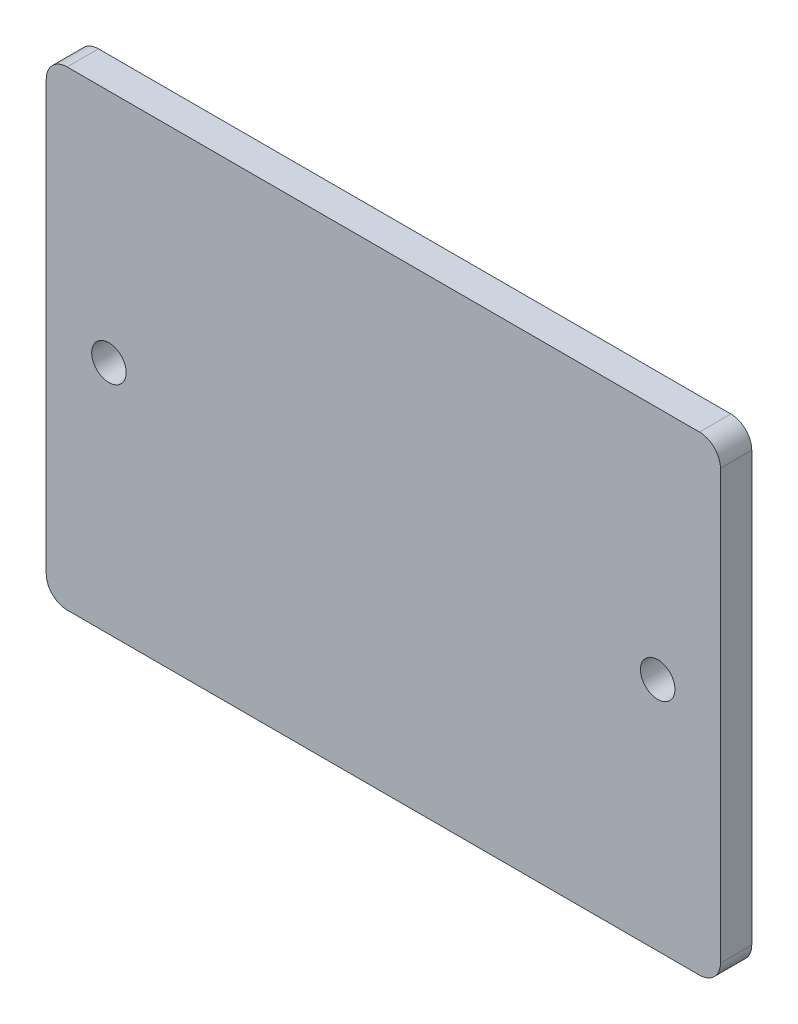
ISO-10303-21;
HEADER;
FILE_DESCRIPTION(('STEP AP214'),'2;1');
FILE_NAME('part.step','',(''),(''),'','','');
FILE_SCHEMA(('AUTOMOTIVE_DESIGN { 1 0 10303 214 1 1 1 1 }'));
ENDSEC;
DATA;
#1=APPLICATION_CONTEXT('core data for automotive mechanical design processes');
#2=APPLICATION_PROTOCOL_DEFINITION('international standard','automotive_design',2000,#1);
#3=PRODUCT_CONTEXT('',#1,'mechanical');
#4=PRODUCT('Part','Part','',(#3));
#5=PRODUCT_RELATED_PRODUCT_CATEGORY('part','',(#4));
#6=PRODUCT_DEFINITION_FORMATION('','',#4);
#7=PRODUCT_DEFINITION_CONTEXT('part definition',#1,'design');
#8=PRODUCT_DEFINITION('design','',#6,#7);
#9=PRODUCT_DEFINITION_SHAPE('','',#8);
#10=(LENGTH_UNIT() NAMED_UNIT(*) SI_UNIT(.MILLI.,.METRE.));
#11=(NAMED_UNIT(*) PLANE_ANGLE_UNIT() SI_UNIT($,.RADIAN.));
#12=(NAMED_UNIT(*) SI_UNIT($,.STERADIAN.) SOLID_ANGLE_UNIT());
#13=UNCERTAINTY_MEASURE_WITH_UNIT(LENGTH_MEASURE(1.E-05),#10,'distance_accuracy_value','');
#14=(GEOMETRIC_REPRESENTATION_CONTEXT(3) GLOBAL_UNCERTAINTY_ASSIGNED_CONTEXT((#13)) GLOBAL_UNIT_ASSIGNED_CONTEXT((#10,
#11,#12)) REPRESENTATION_CONTEXT('',''));
#15=CARTESIAN_POINT('',(0.,0.,0.));
#16=DIRECTION('',(0.,0.,1.));
#17=DIRECTION('',(1.,0.,0.));
#18=AXIS2_PLACEMENT_3D('',#15,#16,#17);
#19=CARTESIAN_POINT('',(32.25,-22.5,3.));
#20=DIRECTION('',(-1.,0.,0.));
#21=DIRECTION('',(0.,0.,1.));
#22=AXIS2_PLACEMENT_3D('',#19,#20,#21);
#23=PLANE('',#22);
#24=DIRECTION('',(0.,0.,-1.));
#25=VECTOR('',#24,1.);
#26=CARTESIAN_POINT('',(32.25,-20.5,3.));
#27=LINE('',#26,#25);
#28=CARTESIAN_POINT('',(32.25,-20.5,3.));
#29=VERTEX_POINT('',#28);
#30=CARTESIAN_POINT('',(32.25,-20.5,0.));
#31=VERTEX_POINT('',#30);
#32=EDGE_CURVE('E150',#29,#31,#27,.T.);
#33=ORIENTED_EDGE('',*,*,#32,.T.);
#34=DIRECTION('',(0.,1.,0.));
#35=VECTOR('',#34,1.);
#36=CARTESIAN_POINT('',(32.25,-22.5,0.));
#37=LINE('',#36,#35);
#38=CARTESIAN_POINT('',(32.25,20.5,0.));
#39=VERTEX_POINT('',#38);
#40=EDGE_CURVE('E130',#31,#39,#37,.T.);
#41=ORIENTED_EDGE('',*,*,#40,.T.);
#42=DIRECTION('',(0.,0.,-1.));
#43=VECTOR('',#42,1.);
#44=CARTESIAN_POINT('',(32.25,20.5,3.));
#45=LINE('',#44,#43);
#46=CARTESIAN_POINT('',(32.25,20.5,3.));
#47=VERTEX_POINT('',#46);
#48=EDGE_CURVE('E148',#39,#47,#45,.F.);
#49=ORIENTED_EDGE('',*,*,#48,.T.);
#50=DIRECTION('',(0.,1.,0.));
#51=VECTOR('',#50,1.);
#52=CARTESIAN_POINT('',(32.25,-22.5,3.));
#53=LINE('',#52,#51);
#54=EDGE_CURVE('E51',#29,#47,#53,.T.);
#55=ORIENTED_EDGE('',*,*,#54,.F.);
#56=EDGE_LOOP('',(#33,#41,#49,#55));
#57=FACE_BOUND('',#56,.T.);
#58=ADVANCED_FACE('F34',(#57),#23,.F.);
#59=CARTESIAN_POINT('',(-32.25,22.5,3.));
#60=DIRECTION('',(0.,-1.,0.));
#61=DIRECTION('',(0.,0.,-1.));
#62=AXIS2_PLACEMENT_3D('',#59,#60,#61);
#63=PLANE('',#62);
#64=DIRECTION('',(-1.,0.,0.));
#65=VECTOR('',#64,1.);
#66=CARTESIAN_POINT('',(-32.25,22.5,0.));
#67=LINE('',#66,#65);
#68=CARTESIAN_POINT('',(30.25,22.5,0.));
#69=VERTEX_POINT('',#68);
#70=CARTESIAN_POINT('',(-30.25,22.5,0.));
#71=VERTEX_POINT('',#70);
#72=EDGE_CURVE('E126',#69,#71,#67,.T.);
#73=ORIENTED_EDGE('',*,*,#72,.T.);
#74=DIRECTION('',(0.,0.,-1.));
#75=VECTOR('',#74,1.);
#76=CARTESIAN_POINT('',(-30.25,22.5,3.));
#77=LINE('',#76,#75);
#78=CARTESIAN_POINT('',(-30.25,22.5,3.));
#79=VERTEX_POINT('',#78);
#80=EDGE_CURVE('E105',#71,#79,#77,.F.);
#81=ORIENTED_EDGE('',*,*,#80,.T.);
#82=DIRECTION('',(-1.,0.,0.));
#83=VECTOR('',#82,1.);
#84=CARTESIAN_POINT('',(-32.25,22.5,3.));
#85=LINE('',#84,#83);
#86=CARTESIAN_POINT('',(30.25,22.5,3.));
#87=VERTEX_POINT('',#86);
#88=EDGE_CURVE('E171',#87,#79,#85,.T.);
#89=ORIENTED_EDGE('',*,*,#88,.F.);
#90=DIRECTION('',(0.,0.,-1.));
#91=VECTOR('',#90,1.);
#92=CARTESIAN_POINT('',(30.25,22.5,3.));
#93=LINE('',#92,#91);
#94=EDGE_CURVE('E110',#87,#69,#93,.T.);
#95=ORIENTED_EDGE('',*,*,#94,.T.);
#96=EDGE_LOOP('',(#73,#81,#89,#95));
#97=FACE_BOUND('',#96,.T.);
#98=ADVANCED_FACE('F187',(#97),#63,.F.);
#99=CARTESIAN_POINT('',(-32.25,-22.5,3.));
#100=DIRECTION('',(1.,0.,0.));
#101=DIRECTION('',(0.,0.,-1.));
#102=AXIS2_PLACEMENT_3D('',#99,#100,#101);
#103=PLANE('',#102);
#104=DIRECTION('',(0.,-1.,0.));
#105=VECTOR('',#104,1.);
#106=CARTESIAN_POINT('',(-32.25,-22.5,0.));
#107=LINE('',#106,#105);
#108=CARTESIAN_POINT('',(-32.25,20.5,0.));
#109=VERTEX_POINT('',#108);
#110=CARTESIAN_POINT('',(-32.25,-20.5,0.));
#111=VERTEX_POINT('',#110);
#112=EDGE_CURVE('E116',#109,#111,#107,.T.);
#113=ORIENTED_EDGE('',*,*,#112,.T.);
#114=DIRECTION('',(0.,0.,-1.));
#115=VECTOR('',#114,1.);
#116=CARTESIAN_POINT('',(-32.25,-20.5,3.));
#117=LINE('',#116,#115);
#118=CARTESIAN_POINT('',(-32.25,-20.5,3.));
#119=VERTEX_POINT('',#118);
#120=EDGE_CURVE('E11',#111,#119,#117,.F.);
#121=ORIENTED_EDGE('',*,*,#120,.T.);
#122=DIRECTION('',(0.,-1.,0.));
#123=VECTOR('',#122,1.);
#124=CARTESIAN_POINT('',(-32.25,-22.5,3.));
#125=LINE('',#124,#123);
#126=CARTESIAN_POINT('',(-32.25,20.5,3.));
#127=VERTEX_POINT('',#126);
#128=EDGE_CURVE('E118',#127,#119,#125,.T.);
#129=ORIENTED_EDGE('',*,*,#128,.F.);
#130=DIRECTION('',(0.,0.,-1.));
#131=VECTOR('',#130,1.);
#132=CARTESIAN_POINT('',(-32.25,20.5,3.));
#133=LINE('',#132,#131);
#134=EDGE_CURVE('E104',#127,#109,#133,.T.);
#135=ORIENTED_EDGE('',*,*,#134,.T.);
#136=EDGE_LOOP('',(#113,#121,#129,#135));
#137=FACE_BOUND('',#136,.T.);
#138=ADVANCED_FACE('F115',(#137),#103,.F.);
#139=CARTESIAN_POINT('',(-32.25,-22.5,3.));
#140=DIRECTION('',(0.,1.,0.));
#141=DIRECTION('',(0.,0.,1.));
#142=AXIS2_PLACEMENT_3D('',#139,#140,#141);
#143=PLANE('',#142);
#144=DIRECTION('',(1.,0.,0.));
#145=VECTOR('',#144,1.);
#146=CARTESIAN_POINT('',(-32.25,-22.5,0.));
#147=LINE('',#146,#145);
#148=CARTESIAN_POINT('',(-30.25,-22.5,0.));
#149=VERTEX_POINT('',#148);
#150=CARTESIAN_POINT('',(30.25,-22.5,0.));
#151=VERTEX_POINT('',#150);
#152=EDGE_CURVE('E125',#149,#151,#147,.T.);
#153=ORIENTED_EDGE('',*,*,#152,.T.);
#154=DIRECTION('',(0.,0.,-1.));
#155=VECTOR('',#154,1.);
#156=CARTESIAN_POINT('',(30.25,-22.5,3.));
#157=LINE('',#156,#155);
#158=CARTESIAN_POINT('',(30.25,-22.5,3.));
#159=VERTEX_POINT('',#158);
#160=EDGE_CURVE('E43',#151,#159,#157,.F.);
#161=ORIENTED_EDGE('',*,*,#160,.T.);
#162=DIRECTION('',(1.,0.,0.));
#163=VECTOR('',#162,1.);
#164=CARTESIAN_POINT('',(-32.25,-22.5,3.));
#165=LINE('',#164,#163);
#166=CARTESIAN_POINT('',(-30.25,-22.5,3.));
#167=VERTEX_POINT('',#166);
#168=EDGE_CURVE('E120',#167,#159,#165,.T.);
#169=ORIENTED_EDGE('',*,*,#168,.F.);
#170=DIRECTION('',(0.,0.,-1.));
#171=VECTOR('',#170,1.);
#172=CARTESIAN_POINT('',(-30.25,-22.5,3.));
#173=LINE('',#172,#171);
#174=EDGE_CURVE('E153',#167,#149,#173,.T.);
#175=ORIENTED_EDGE('',*,*,#174,.T.);
#176=EDGE_LOOP('',(#153,#161,#169,#175));
#177=FACE_BOUND('',#176,.T.);
#178=ADVANCED_FACE('F194',(#177),#143,.F.);
#179=CARTESIAN_POINT('',(0.,0.,3.));
#180=DIRECTION('',(0.,0.,-1.));
#181=DIRECTION('',(-1.,0.,0.));
#182=AXIS2_PLACEMENT_3D('',#179,#180,#181);
#183=PLANE('',#182);
#184=CARTESIAN_POINT('',(-26.25,0.,3.));
#185=DIRECTION('',(0.,0.,1.));
#186=DIRECTION('',(1.,0.,0.));
#187=AXIS2_PLACEMENT_3D('',#184,#185,#186);
#188=CIRCLE('',#187,1.65);
#189=CARTESIAN_POINT('',(-24.6,0.,3.));
#190=VERTEX_POINT('',#189);
#191=EDGE_CURVE('E158',#190,#190,#188,.T.);
#192=ORIENTED_EDGE('',*,*,#191,.F.);
#193=EDGE_LOOP('',(#192));
#194=FACE_BOUND('',#193,.T.);
#195=CARTESIAN_POINT('',(26.25,0.,3.));
#196=DIRECTION('',(0.,0.,1.));
#197=DIRECTION('',(-1.,0.,0.));
#198=AXIS2_PLACEMENT_3D('',#195,#196,#197);
#199=CIRCLE('',#198,1.65);
#200=CARTESIAN_POINT('',(24.6,0.,3.));
#201=VERTEX_POINT('',#200);
#202=EDGE_CURVE('E163',#201,#201,#199,.T.);
#203=ORIENTED_EDGE('',*,*,#202,.F.);
#204=EDGE_LOOP('',(#203));
#205=FACE_BOUND('',#204,.T.);
#206=ORIENTED_EDGE('',*,*,#128,.T.);
#207=CARTESIAN_POINT('',(-30.25,-20.5,3.));
#208=DIRECTION('',(0.,0.,-1.));
#209=DIRECTION('',(-1.,0.,0.));
#210=AXIS2_PLACEMENT_3D('',#207,#208,#209);
#211=CIRCLE('',#210,2.);
#212=EDGE_CURVE('E141',#119,#167,#211,.F.);
#213=ORIENTED_EDGE('',*,*,#212,.T.);
#214=ORIENTED_EDGE('',*,*,#168,.T.);
#215=CARTESIAN_POINT('',(30.25,-20.5,3.));
#216=DIRECTION('',(0.,0.,-1.));
#217=DIRECTION('',(-1.,0.,0.));
#218=AXIS2_PLACEMENT_3D('',#215,#216,#217);
#219=CIRCLE('',#218,2.);
#220=EDGE_CURVE('E56',#159,#29,#219,.F.);
#221=ORIENTED_EDGE('',*,*,#220,.T.);
#222=ORIENTED_EDGE('',*,*,#54,.T.);
#223=CARTESIAN_POINT('',(30.25,20.5,3.));
#224=DIRECTION('',(0.,0.,-1.));
#225=DIRECTION('',(-1.,0.,0.));
#226=AXIS2_PLACEMENT_3D('',#223,#224,#225);
#227=CIRCLE('',#226,2.);
#228=EDGE_CURVE('E144',#47,#87,#227,.F.);
#229=ORIENTED_EDGE('',*,*,#228,.T.);
#230=ORIENTED_EDGE('',*,*,#88,.T.);
#231=CARTESIAN_POINT('',(-30.25,20.5,3.));
#232=DIRECTION('',(0.,0.,-1.));
#233=DIRECTION('',(-1.,0.,0.));
#234=AXIS2_PLACEMENT_3D('',#231,#232,#233);
#235=CIRCLE('',#234,2.);
#236=EDGE_CURVE('E146',#79,#127,#235,.F.);
#237=ORIENTED_EDGE('',*,*,#236,.T.);
#238=EDGE_LOOP('',(#206,#213,#214,#221,#222,#229,#230,#237));
#239=FACE_BOUND('',#238,.T.);
#240=ADVANCED_FACE('F185',(#194,#205,#239),#183,.F.);
#241=CARTESIAN_POINT('',(0.,0.,0.));
#242=DIRECTION('',(0.,0.,-1.));
#243=DIRECTION('',(-1.,0.,0.));
#244=AXIS2_PLACEMENT_3D('',#241,#242,#243);
#245=PLANE('',#244);
#246=CARTESIAN_POINT('',(-26.25,0.,0.));
#247=DIRECTION('',(0.,0.,-1.));
#248=DIRECTION('',(-1.,0.,0.));
#249=AXIS2_PLACEMENT_3D('',#246,#247,#248);
#250=CIRCLE('',#249,1.65);
#251=CARTESIAN_POINT('',(-27.9,0.,0.));
#252=VERTEX_POINT('',#251);
#253=EDGE_CURVE('E38',#252,#252,#250,.T.);
#254=ORIENTED_EDGE('',*,*,#253,.F.);
#255=EDGE_LOOP('',(#254));
#256=FACE_BOUND('',#255,.T.);
#257=CARTESIAN_POINT('',(26.25,0.,0.));
#258=DIRECTION('',(0.,0.,-1.));
#259=DIRECTION('',(-1.,0.,0.));
#260=AXIS2_PLACEMENT_3D('',#257,#258,#259);
#261=CIRCLE('',#260,1.65);
#262=CARTESIAN_POINT('',(24.6,0.,0.));
#263=VERTEX_POINT('',#262);
#264=EDGE_CURVE('E156',#263,#263,#261,.T.);
#265=ORIENTED_EDGE('',*,*,#264,.F.);
#266=EDGE_LOOP('',(#265));
#267=FACE_BOUND('',#266,.T.);
#268=CARTESIAN_POINT('',(-30.25,-20.5,0.));
#269=DIRECTION('',(0.,0.,-1.));
#270=DIRECTION('',(-1.,0.,0.));
#271=AXIS2_PLACEMENT_3D('',#268,#269,#270);
#272=CIRCLE('',#271,2.);
#273=EDGE_CURVE('E119',#149,#111,#272,.T.);
#274=ORIENTED_EDGE('',*,*,#273,.T.);
#275=ORIENTED_EDGE('',*,*,#112,.F.);
#276=CARTESIAN_POINT('',(-30.25,20.5,0.));
#277=DIRECTION('',(0.,0.,-1.));
#278=DIRECTION('',(-1.,0.,0.));
#279=AXIS2_PLACEMENT_3D('',#276,#277,#278);
#280=CIRCLE('',#279,2.);
#281=EDGE_CURVE('E100',#109,#71,#280,.T.);
#282=ORIENTED_EDGE('',*,*,#281,.T.);
#283=ORIENTED_EDGE('',*,*,#72,.F.);
#284=CARTESIAN_POINT('',(30.25,20.5,0.));
#285=DIRECTION('',(0.,0.,-1.));
#286=DIRECTION('',(-1.,0.,0.));
#287=AXIS2_PLACEMENT_3D('',#284,#285,#286);
#288=CIRCLE('',#287,2.);
#289=EDGE_CURVE('E111',#69,#39,#288,.T.);
#290=ORIENTED_EDGE('',*,*,#289,.T.);
#291=ORIENTED_EDGE('',*,*,#40,.F.);
#292=CARTESIAN_POINT('',(30.25,-20.5,0.));
#293=DIRECTION('',(0.,0.,-1.));
#294=DIRECTION('',(-1.,0.,0.));
#295=AXIS2_PLACEMENT_3D('',#292,#293,#294);
#296=CIRCLE('',#295,2.);
#297=EDGE_CURVE('E135',#31,#151,#296,.T.);
#298=ORIENTED_EDGE('',*,*,#297,.T.);
#299=ORIENTED_EDGE('',*,*,#152,.F.);
#300=EDGE_LOOP('',(#274,#275,#282,#283,#290,#291,#298,#299));
#301=FACE_BOUND('',#300,.T.);
#302=ADVANCED_FACE('F122',(#256,#267,#301),#245,.T.);
#303=CARTESIAN_POINT('',(-30.25,20.5,3.));
#304=DIRECTION('',(0.,0.,-1.));
#305=DIRECTION('',(-1.,0.,0.));
#306=AXIS2_PLACEMENT_3D('',#303,#304,#305);
#307=CYLINDRICAL_SURFACE('',#306,2.);
#308=ORIENTED_EDGE('',*,*,#236,.F.);
#309=ORIENTED_EDGE('',*,*,#80,.F.);
#310=ORIENTED_EDGE('',*,*,#281,.F.);
#311=ORIENTED_EDGE('',*,*,#134,.F.);
#312=EDGE_LOOP('',(#308,#309,#310,#311));
#313=FACE_BOUND('',#312,.T.);
#314=ADVANCED_FACE('F103',(#313),#307,.T.);
#315=CARTESIAN_POINT('',(30.25,20.5,3.));
#316=DIRECTION('',(0.,0.,-1.));
#317=DIRECTION('',(-1.,0.,0.));
#318=AXIS2_PLACEMENT_3D('',#315,#316,#317);
#319=CYLINDRICAL_SURFACE('',#318,2.);
#320=ORIENTED_EDGE('',*,*,#228,.F.);
#321=ORIENTED_EDGE('',*,*,#48,.F.);
#322=ORIENTED_EDGE('',*,*,#289,.F.);
#323=ORIENTED_EDGE('',*,*,#94,.F.);
#324=EDGE_LOOP('',(#320,#321,#322,#323));
#325=FACE_BOUND('',#324,.T.);
#326=ADVANCED_FACE('F182',(#325),#319,.T.);
#327=CARTESIAN_POINT('',(30.25,-20.5,3.));
#328=DIRECTION('',(0.,0.,-1.));
#329=DIRECTION('',(-1.,0.,0.));
#330=AXIS2_PLACEMENT_3D('',#327,#328,#329);
#331=CYLINDRICAL_SURFACE('',#330,2.);
#332=ORIENTED_EDGE('',*,*,#220,.F.);
#333=ORIENTED_EDGE('',*,*,#160,.F.);
#334=ORIENTED_EDGE('',*,*,#297,.F.);
#335=ORIENTED_EDGE('',*,*,#32,.F.);
#336=EDGE_LOOP('',(#332,#333,#334,#335));
#337=FACE_BOUND('',#336,.T.);
#338=ADVANCED_FACE('F202',(#337),#331,.T.);
#339=CARTESIAN_POINT('',(-30.25,-20.5,3.));
#340=DIRECTION('',(0.,0.,-1.));
#341=DIRECTION('',(-1.,0.,0.));
#342=AXIS2_PLACEMENT_3D('',#339,#340,#341);
#343=CYLINDRICAL_SURFACE('',#342,2.);
#344=ORIENTED_EDGE('',*,*,#212,.F.);
#345=ORIENTED_EDGE('',*,*,#120,.F.);
#346=ORIENTED_EDGE('',*,*,#273,.F.);
#347=ORIENTED_EDGE('',*,*,#174,.F.);
#348=EDGE_LOOP('',(#344,#345,#346,#347));
#349=FACE_BOUND('',#348,.T.);
#350=ADVANCED_FACE('F36',(#349),#343,.T.);
#351=CARTESIAN_POINT('',(26.25,0.,-7.));
#352=DIRECTION('',(0.,0.,1.));
#353=DIRECTION('',(1.,0.,0.));
#354=AXIS2_PLACEMENT_3D('',#351,#352,#353);
#355=CYLINDRICAL_SURFACE('',#354,1.65);
#356=ORIENTED_EDGE('',*,*,#264,.T.);
#357=EDGE_LOOP('',(#356));
#358=FACE_BOUND('',#357,.T.);
#359=ORIENTED_EDGE('',*,*,#202,.T.);
#360=EDGE_LOOP('',(#359));
#361=FACE_BOUND('',#360,.T.);
#362=ADVANCED_FACE('F208',(#358,#361),#355,.F.);
#363=CARTESIAN_POINT('',(-26.25,0.,-7.));
#364=DIRECTION('',(0.,0.,1.));
#365=DIRECTION('',(1.,0.,0.));
#366=AXIS2_PLACEMENT_3D('',#363,#364,#365);
#367=CYLINDRICAL_SURFACE('',#366,1.65);
#368=ORIENTED_EDGE('',*,*,#253,.T.);
#369=EDGE_LOOP('',(#368));
#370=FACE_BOUND('',#369,.T.);
#371=ORIENTED_EDGE('',*,*,#191,.T.);
#372=EDGE_LOOP('',(#371));
#373=FACE_BOUND('',#372,.T.);
#374=ADVANCED_FACE('F227',(#370,#373),#367,.F.);
#375=CLOSED_SHELL('',(#58,#98,#138,#178,#240,#302,#314,#326,#338,#350,#362,#374));
#376=MANIFOLD_SOLID_BREP('B2',#375);
#377=ADVANCED_BREP_SHAPE_REPRESENTATION('',(#18,#376),#14);
#378=SHAPE_DEFINITION_REPRESENTATION(#9,#377);
ENDSEC;
END-ISO-10303-21;
